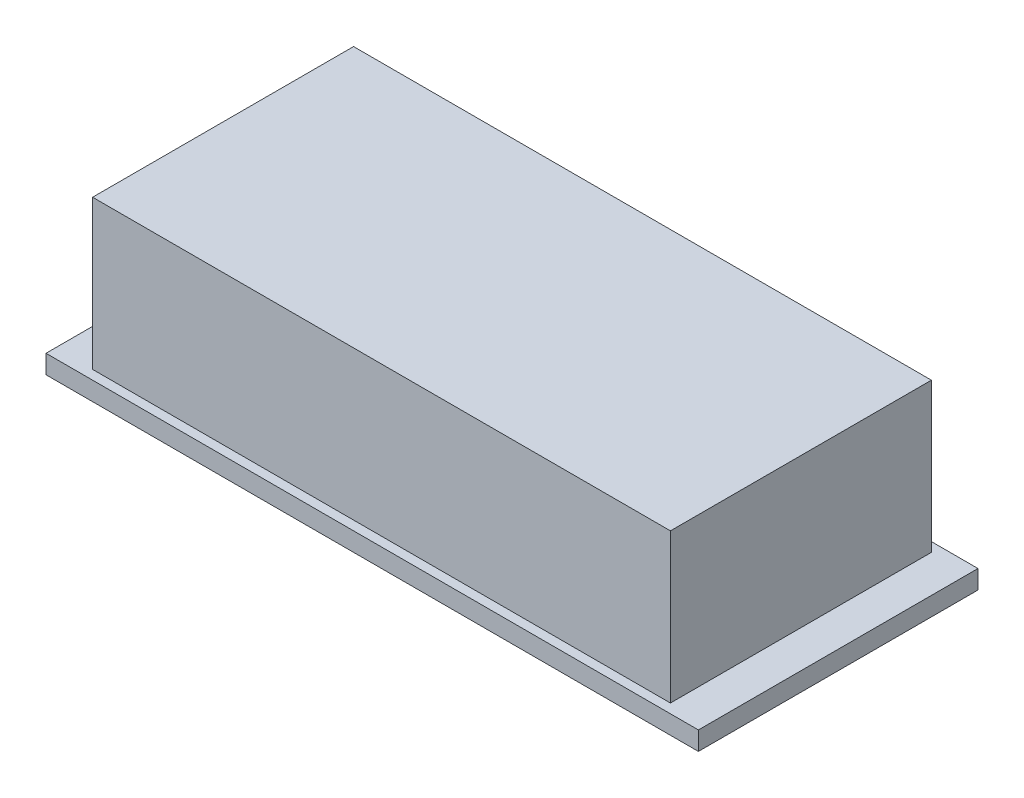
ISO-10303-21;
HEADER;
FILE_DESCRIPTION(('STEP AP214'),'2;1');
FILE_NAME('part.step','',(''),(''),'','','');
FILE_SCHEMA(('AUTOMOTIVE_DESIGN { 1 0 10303 214 1 1 1 1 }'));
ENDSEC;
DATA;
#1=APPLICATION_CONTEXT('core data for automotive mechanical design processes');
#2=APPLICATION_PROTOCOL_DEFINITION('international standard','automotive_design',2000,#1);
#3=PRODUCT_CONTEXT('',#1,'mechanical');
#4=PRODUCT('Part','Part','',(#3));
#5=PRODUCT_RELATED_PRODUCT_CATEGORY('part','',(#4));
#6=PRODUCT_DEFINITION_FORMATION('','',#4);
#7=PRODUCT_DEFINITION_CONTEXT('part definition',#1,'design');
#8=PRODUCT_DEFINITION('design','',#6,#7);
#9=PRODUCT_DEFINITION_SHAPE('','',#8);
#10=(LENGTH_UNIT() NAMED_UNIT(*) SI_UNIT(.MILLI.,.METRE.));
#11=(NAMED_UNIT(*) PLANE_ANGLE_UNIT() SI_UNIT($,.RADIAN.));
#12=(NAMED_UNIT(*) SI_UNIT($,.STERADIAN.) SOLID_ANGLE_UNIT());
#13=UNCERTAINTY_MEASURE_WITH_UNIT(LENGTH_MEASURE(1.E-05),#10,'distance_accuracy_value','');
#14=(GEOMETRIC_REPRESENTATION_CONTEXT(3) GLOBAL_UNCERTAINTY_ASSIGNED_CONTEXT((#13)) GLOBAL_UNIT_ASSIGNED_CONTEXT((#10,
#11,#12)) REPRESENTATION_CONTEXT('',''));
#15=CARTESIAN_POINT('',(0.,0.,0.));
#16=DIRECTION('',(0.,0.,1.));
#17=DIRECTION('',(1.,0.,0.));
#18=AXIS2_PLACEMENT_3D('',#15,#16,#17);
#19=CARTESIAN_POINT('',(0.,2.,0.));
#20=DIRECTION('',(0.,-1.,0.));
#21=DIRECTION('',(0.,0.,-1.));
#22=AXIS2_PLACEMENT_3D('',#19,#20,#21);
#23=PLANE('',#22);
#24=DIRECTION('',(0.,0.,1.));
#25=VECTOR('',#24,1.);
#26=CARTESIAN_POINT('',(0.,2.,0.));
#27=LINE('',#26,#25);
#28=CARTESIAN_POINT('',(0.,2.,-30.));
#29=VERTEX_POINT('',#28);
#30=CARTESIAN_POINT('',(0.,2.,0.));
#31=VERTEX_POINT('',#30);
#32=EDGE_CURVE('E139',#29,#31,#27,.T.);
#33=ORIENTED_EDGE('',*,*,#32,.T.);
#34=DIRECTION('',(1.,0.,0.));
#35=VECTOR('',#34,1.);
#36=CARTESIAN_POINT('',(0.,2.,0.));
#37=LINE('',#36,#35);
#38=CARTESIAN_POINT('',(70.,2.,0.));
#39=VERTEX_POINT('',#38);
#40=EDGE_CURVE('E142',#31,#39,#37,.T.);
#41=ORIENTED_EDGE('',*,*,#40,.T.);
#42=DIRECTION('',(0.,0.,-1.));
#43=VECTOR('',#42,1.);
#44=CARTESIAN_POINT('',(70.,2.,0.));
#45=LINE('',#44,#43);
#46=CARTESIAN_POINT('',(70.,2.,-30.));
#47=VERTEX_POINT('',#46);
#48=EDGE_CURVE('E145',#39,#47,#45,.T.);
#49=ORIENTED_EDGE('',*,*,#48,.T.);
#50=DIRECTION('',(-1.,0.,0.));
#51=VECTOR('',#50,1.);
#52=CARTESIAN_POINT('',(0.,2.,-30.));
#53=LINE('',#52,#51);
#54=EDGE_CURVE('E147',#47,#29,#53,.T.);
#55=ORIENTED_EDGE('',*,*,#54,.T.);
#56=EDGE_LOOP('',(#33,#41,#49,#55));
#57=FACE_BOUND('',#56,.T.);
#58=DIRECTION('',(0.,0.,1.));
#59=VECTOR('',#58,1.);
#60=CARTESIAN_POINT('',(4.,2.,-29.));
#61=LINE('',#60,#59);
#62=CARTESIAN_POINT('',(4.,2.,-29.));
#63=VERTEX_POINT('',#62);
#64=CARTESIAN_POINT('',(4.,2.,-1.));
#65=VERTEX_POINT('',#64);
#66=EDGE_CURVE('E60',#63,#65,#61,.T.);
#67=ORIENTED_EDGE('',*,*,#66,.F.);
#68=DIRECTION('',(-1.,0.,0.));
#69=VECTOR('',#68,1.);
#70=CARTESIAN_POINT('',(4.,2.,-29.));
#71=LINE('',#70,#69);
#72=CARTESIAN_POINT('',(66.,2.,-29.));
#73=VERTEX_POINT('',#72);
#74=EDGE_CURVE('E64',#73,#63,#71,.T.);
#75=ORIENTED_EDGE('',*,*,#74,.F.);
#76=DIRECTION('',(0.,0.,-1.));
#77=VECTOR('',#76,1.);
#78=CARTESIAN_POINT('',(66.,2.,-29.));
#79=LINE('',#78,#77);
#80=CARTESIAN_POINT('',(66.,2.,-1.));
#81=VERTEX_POINT('',#80);
#82=EDGE_CURVE('E274',#81,#73,#79,.T.);
#83=ORIENTED_EDGE('',*,*,#82,.F.);
#84=DIRECTION('',(1.,0.,0.));
#85=VECTOR('',#84,1.);
#86=CARTESIAN_POINT('',(4.,2.,-1.));
#87=LINE('',#86,#85);
#88=EDGE_CURVE('E280',#65,#81,#87,.T.);
#89=ORIENTED_EDGE('',*,*,#88,.F.);
#90=EDGE_LOOP('',(#67,#75,#83,#89));
#91=FACE_BOUND('',#90,.T.);
#92=ADVANCED_FACE('F45',(#57,#91),#23,.F.);
#93=CARTESIAN_POINT('',(0.,2.,0.));
#94=DIRECTION('',(1.,0.,0.));
#95=DIRECTION('',(0.,0.,-1.));
#96=AXIS2_PLACEMENT_3D('',#93,#94,#95);
#97=PLANE('',#96);
#98=DIRECTION('',(0.,0.,1.));
#99=VECTOR('',#98,1.);
#100=CARTESIAN_POINT('',(0.,0.,0.));
#101=LINE('',#100,#99);
#102=CARTESIAN_POINT('',(0.,0.,-30.));
#103=VERTEX_POINT('',#102);
#104=CARTESIAN_POINT('',(0.,0.,0.));
#105=VERTEX_POINT('',#104);
#106=EDGE_CURVE('E130',#103,#105,#101,.T.);
#107=ORIENTED_EDGE('',*,*,#106,.T.);
#108=DIRECTION('',(0.,-1.,0.));
#109=VECTOR('',#108,1.);
#110=CARTESIAN_POINT('',(0.,2.,0.));
#111=LINE('',#110,#109);
#112=EDGE_CURVE('E11',#31,#105,#111,.T.);
#113=ORIENTED_EDGE('',*,*,#112,.F.);
#114=ORIENTED_EDGE('',*,*,#32,.F.);
#115=DIRECTION('',(0.,-1.,0.));
#116=VECTOR('',#115,1.);
#117=CARTESIAN_POINT('',(0.,2.,-30.));
#118=LINE('',#117,#116);
#119=EDGE_CURVE('E148',#29,#103,#118,.T.);
#120=ORIENTED_EDGE('',*,*,#119,.T.);
#121=EDGE_LOOP('',(#107,#113,#114,#120));
#122=FACE_BOUND('',#121,.T.);
#123=ADVANCED_FACE('F47',(#122),#97,.F.);
#124=CARTESIAN_POINT('',(0.,2.,0.));
#125=DIRECTION('',(0.,0.,-1.));
#126=DIRECTION('',(-1.,0.,0.));
#127=AXIS2_PLACEMENT_3D('',#124,#125,#126);
#128=PLANE('',#127);
#129=DIRECTION('',(1.,0.,0.));
#130=VECTOR('',#129,1.);
#131=CARTESIAN_POINT('',(0.,0.,0.));
#132=LINE('',#131,#130);
#133=CARTESIAN_POINT('',(70.,0.,0.));
#134=VERTEX_POINT('',#133);
#135=EDGE_CURVE('E133',#105,#134,#132,.T.);
#136=ORIENTED_EDGE('',*,*,#135,.T.);
#137=DIRECTION('',(0.,-1.,0.));
#138=VECTOR('',#137,1.);
#139=CARTESIAN_POINT('',(70.,2.,0.));
#140=LINE('',#139,#138);
#141=EDGE_CURVE('E53',#39,#134,#140,.T.);
#142=ORIENTED_EDGE('',*,*,#141,.F.);
#143=ORIENTED_EDGE('',*,*,#40,.F.);
#144=ORIENTED_EDGE('',*,*,#112,.T.);
#145=EDGE_LOOP('',(#136,#142,#143,#144));
#146=FACE_BOUND('',#145,.T.);
#147=ADVANCED_FACE('F178',(#146),#128,.F.);
#148=CARTESIAN_POINT('',(70.,2.,0.));
#149=DIRECTION('',(-1.,0.,0.));
#150=DIRECTION('',(0.,0.,1.));
#151=AXIS2_PLACEMENT_3D('',#148,#149,#150);
#152=PLANE('',#151);
#153=DIRECTION('',(0.,0.,-1.));
#154=VECTOR('',#153,1.);
#155=CARTESIAN_POINT('',(70.,0.,0.));
#156=LINE('',#155,#154);
#157=CARTESIAN_POINT('',(70.,0.,-30.));
#158=VERTEX_POINT('',#157);
#159=EDGE_CURVE('E151',#134,#158,#156,.T.);
#160=ORIENTED_EDGE('',*,*,#159,.T.);
#161=DIRECTION('',(0.,-1.,0.));
#162=VECTOR('',#161,1.);
#163=CARTESIAN_POINT('',(70.,2.,-30.));
#164=LINE('',#163,#162);
#165=EDGE_CURVE('E156',#47,#158,#164,.T.);
#166=ORIENTED_EDGE('',*,*,#165,.F.);
#167=ORIENTED_EDGE('',*,*,#48,.F.);
#168=ORIENTED_EDGE('',*,*,#141,.T.);
#169=EDGE_LOOP('',(#160,#166,#167,#168));
#170=FACE_BOUND('',#169,.T.);
#171=ADVANCED_FACE('F163',(#170),#152,.F.);
#172=CARTESIAN_POINT('',(0.,2.,-30.));
#173=DIRECTION('',(0.,0.,1.));
#174=DIRECTION('',(1.,0.,0.));
#175=AXIS2_PLACEMENT_3D('',#172,#173,#174);
#176=PLANE('',#175);
#177=DIRECTION('',(-1.,0.,0.));
#178=VECTOR('',#177,1.);
#179=CARTESIAN_POINT('',(0.,0.,-30.));
#180=LINE('',#179,#178);
#181=EDGE_CURVE('E143',#158,#103,#180,.T.);
#182=ORIENTED_EDGE('',*,*,#181,.T.);
#183=ORIENTED_EDGE('',*,*,#119,.F.);
#184=ORIENTED_EDGE('',*,*,#54,.F.);
#185=ORIENTED_EDGE('',*,*,#165,.T.);
#186=EDGE_LOOP('',(#182,#183,#184,#185));
#187=FACE_BOUND('',#186,.T.);
#188=ADVANCED_FACE('F172',(#187),#176,.F.);
#189=CARTESIAN_POINT('',(0.,0.,0.));
#190=DIRECTION('',(0.,-1.,0.));
#191=DIRECTION('',(0.,0.,-1.));
#192=AXIS2_PLACEMENT_3D('',#189,#190,#191);
#193=PLANE('',#192);
#194=ORIENTED_EDGE('',*,*,#106,.F.);
#195=ORIENTED_EDGE('',*,*,#181,.F.);
#196=ORIENTED_EDGE('',*,*,#159,.F.);
#197=ORIENTED_EDGE('',*,*,#135,.F.);
#198=EDGE_LOOP('',(#194,#195,#196,#197));
#199=FACE_BOUND('',#198,.T.);
#200=ADVANCED_FACE('F169',(#199),#193,.T.);
#201=CARTESIAN_POINT('',(4.,18.,-29.));
#202=DIRECTION('',(1.,0.,0.));
#203=DIRECTION('',(0.,0.,-1.));
#204=AXIS2_PLACEMENT_3D('',#201,#202,#203);
#205=PLANE('',#204);
#206=ORIENTED_EDGE('',*,*,#66,.T.);
#207=DIRECTION('',(0.,-1.,0.));
#208=VECTOR('',#207,1.);
#209=CARTESIAN_POINT('',(4.,18.,-1.));
#210=LINE('',#209,#208);
#211=CARTESIAN_POINT('',(4.,18.,-1.));
#212=VERTEX_POINT('',#211);
#213=EDGE_CURVE('E113',#212,#65,#210,.T.);
#214=ORIENTED_EDGE('',*,*,#213,.F.);
#215=DIRECTION('',(0.,0.,1.));
#216=VECTOR('',#215,1.);
#217=CARTESIAN_POINT('',(4.,18.,-29.));
#218=LINE('',#217,#216);
#219=CARTESIAN_POINT('',(4.,18.,-29.));
#220=VERTEX_POINT('',#219);
#221=EDGE_CURVE('E119',#220,#212,#218,.T.);
#222=ORIENTED_EDGE('',*,*,#221,.F.);
#223=DIRECTION('',(0.,-1.,0.));
#224=VECTOR('',#223,1.);
#225=CARTESIAN_POINT('',(4.,18.,-29.));
#226=LINE('',#225,#224);
#227=EDGE_CURVE('E272',#220,#63,#226,.T.);
#228=ORIENTED_EDGE('',*,*,#227,.T.);
#229=EDGE_LOOP('',(#206,#214,#222,#228));
#230=FACE_BOUND('',#229,.T.);
#231=ADVANCED_FACE('F129',(#230),#205,.F.);
#232=CARTESIAN_POINT('',(4.,18.,-1.));
#233=DIRECTION('',(0.,0.,-1.));
#234=DIRECTION('',(-1.,0.,0.));
#235=AXIS2_PLACEMENT_3D('',#232,#233,#234);
#236=PLANE('',#235);
#237=ORIENTED_EDGE('',*,*,#88,.T.);
#238=DIRECTION('',(0.,-1.,0.));
#239=VECTOR('',#238,1.);
#240=CARTESIAN_POINT('',(66.,18.,-1.));
#241=LINE('',#240,#239);
#242=CARTESIAN_POINT('',(66.,18.,-1.));
#243=VERTEX_POINT('',#242);
#244=EDGE_CURVE('E115',#243,#81,#241,.T.);
#245=ORIENTED_EDGE('',*,*,#244,.F.);
#246=DIRECTION('',(1.,0.,0.));
#247=VECTOR('',#246,1.);
#248=CARTESIAN_POINT('',(4.,18.,-1.));
#249=LINE('',#248,#247);
#250=EDGE_CURVE('E108',#212,#243,#249,.T.);
#251=ORIENTED_EDGE('',*,*,#250,.F.);
#252=ORIENTED_EDGE('',*,*,#213,.T.);
#253=EDGE_LOOP('',(#237,#245,#251,#252));
#254=FACE_BOUND('',#253,.T.);
#255=ADVANCED_FACE('F111',(#254),#236,.F.);
#256=CARTESIAN_POINT('',(66.,18.,-29.));
#257=DIRECTION('',(-1.,0.,0.));
#258=DIRECTION('',(0.,0.,1.));
#259=AXIS2_PLACEMENT_3D('',#256,#257,#258);
#260=PLANE('',#259);
#261=ORIENTED_EDGE('',*,*,#82,.T.);
#262=DIRECTION('',(0.,-1.,0.));
#263=VECTOR('',#262,1.);
#264=CARTESIAN_POINT('',(66.,18.,-29.));
#265=LINE('',#264,#263);
#266=CARTESIAN_POINT('',(66.,18.,-29.));
#267=VERTEX_POINT('',#266);
#268=EDGE_CURVE('E135',#267,#73,#265,.T.);
#269=ORIENTED_EDGE('',*,*,#268,.F.);
#270=DIRECTION('',(0.,0.,-1.));
#271=VECTOR('',#270,1.);
#272=CARTESIAN_POINT('',(66.,18.,-29.));
#273=LINE('',#272,#271);
#274=EDGE_CURVE('E118',#243,#267,#273,.T.);
#275=ORIENTED_EDGE('',*,*,#274,.F.);
#276=ORIENTED_EDGE('',*,*,#244,.T.);
#277=EDGE_LOOP('',(#261,#269,#275,#276));
#278=FACE_BOUND('',#277,.T.);
#279=ADVANCED_FACE('F248',(#278),#260,.F.);
#280=CARTESIAN_POINT('',(4.,18.,-29.));
#281=DIRECTION('',(0.,0.,1.));
#282=DIRECTION('',(1.,0.,0.));
#283=AXIS2_PLACEMENT_3D('',#280,#281,#282);
#284=PLANE('',#283);
#285=ORIENTED_EDGE('',*,*,#74,.T.);
#286=ORIENTED_EDGE('',*,*,#227,.F.);
#287=DIRECTION('',(-1.,0.,0.));
#288=VECTOR('',#287,1.);
#289=CARTESIAN_POINT('',(4.,18.,-29.));
#290=LINE('',#289,#288);
#291=EDGE_CURVE('E124',#267,#220,#290,.T.);
#292=ORIENTED_EDGE('',*,*,#291,.F.);
#293=ORIENTED_EDGE('',*,*,#268,.T.);
#294=EDGE_LOOP('',(#285,#286,#292,#293));
#295=FACE_BOUND('',#294,.T.);
#296=ADVANCED_FACE('F254',(#295),#284,.F.);
#297=CARTESIAN_POINT('',(0.,18.,0.));
#298=DIRECTION('',(0.,1.,0.));
#299=DIRECTION('',(0.,0.,1.));
#300=AXIS2_PLACEMENT_3D('',#297,#298,#299);
#301=PLANE('',#300);
#302=ORIENTED_EDGE('',*,*,#221,.T.);
#303=ORIENTED_EDGE('',*,*,#250,.T.);
#304=ORIENTED_EDGE('',*,*,#274,.T.);
#305=ORIENTED_EDGE('',*,*,#291,.T.);
#306=EDGE_LOOP('',(#302,#303,#304,#305));
#307=FACE_BOUND('',#306,.T.);
#308=ADVANCED_FACE('F122',(#307),#301,.T.);
#309=CLOSED_SHELL('',(#92,#123,#147,#171,#188,#200,#231,#255,#279,#296,#308));
#310=MANIFOLD_SOLID_BREP('B2',#309);
#311=ADVANCED_BREP_SHAPE_REPRESENTATION('',(#18,#310),#14);
#312=SHAPE_DEFINITION_REPRESENTATION(#9,#311);
ENDSEC;
END-ISO-10303-21;
